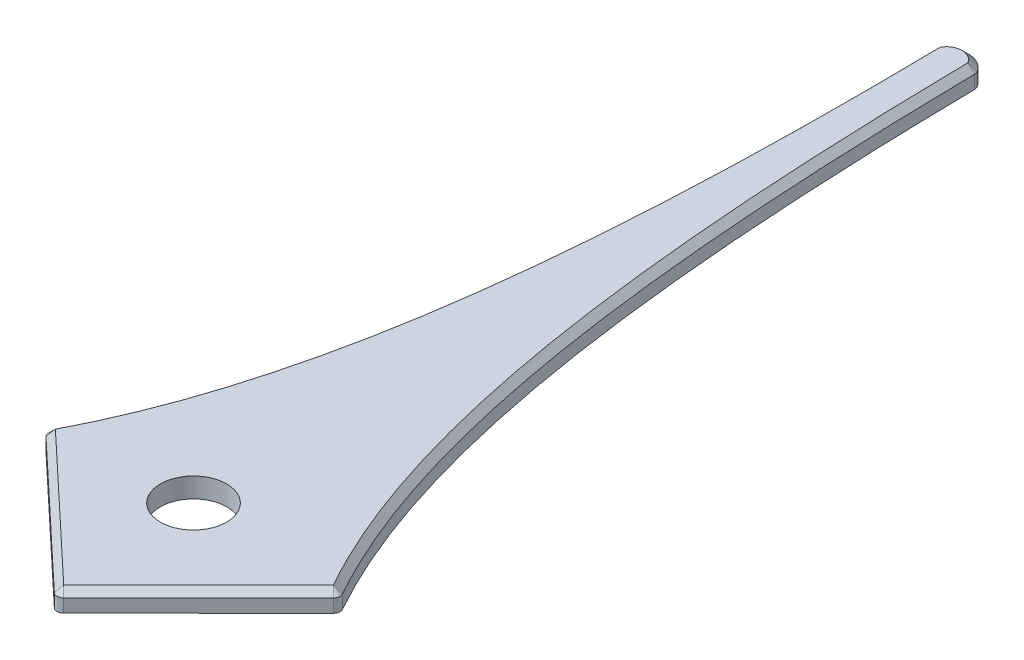
ISO-10303-21;
HEADER;
FILE_DESCRIPTION(('STEP AP214'),'2;1');
FILE_NAME('part.step','',(''),(''),'','','');
FILE_SCHEMA(('AUTOMOTIVE_DESIGN { 1 0 10303 214 1 1 1 1 }'));
ENDSEC;
DATA;
#1=APPLICATION_CONTEXT('core data for automotive mechanical design processes');
#2=APPLICATION_PROTOCOL_DEFINITION('international standard','automotive_design',2000,#1);
#3=PRODUCT_CONTEXT('',#1,'mechanical');
#4=PRODUCT('Part','Part','',(#3));
#5=PRODUCT_RELATED_PRODUCT_CATEGORY('part','',(#4));
#6=PRODUCT_DEFINITION_FORMATION('','',#4);
#7=PRODUCT_DEFINITION_CONTEXT('part definition',#1,'design');
#8=PRODUCT_DEFINITION('design','',#6,#7);
#9=PRODUCT_DEFINITION_SHAPE('','',#8);
#10=(LENGTH_UNIT() NAMED_UNIT(*) SI_UNIT(.MILLI.,.METRE.));
#11=(NAMED_UNIT(*) PLANE_ANGLE_UNIT() SI_UNIT($,.RADIAN.));
#12=(NAMED_UNIT(*) SI_UNIT($,.STERADIAN.) SOLID_ANGLE_UNIT());
#13=UNCERTAINTY_MEASURE_WITH_UNIT(LENGTH_MEASURE(1.E-05),#10,'distance_accuracy_value','');
#14=(GEOMETRIC_REPRESENTATION_CONTEXT(3) GLOBAL_UNCERTAINTY_ASSIGNED_CONTEXT((#13)) GLOBAL_UNIT_ASSIGNED_CONTEXT((#10,
#11,#12)) REPRESENTATION_CONTEXT('',''));
#15=CARTESIAN_POINT('',(0.,0.,0.));
#16=DIRECTION('',(0.,0.,1.));
#17=DIRECTION('',(1.,0.,0.));
#18=AXIS2_PLACEMENT_3D('',#15,#16,#17);
#19=CARTESIAN_POINT('',(-0.84427339324463,0.781119019034748,10.3159980699105));
#20=CARTESIAN_POINT('',(-0.482807728251816,0.781119019034748,9.63484541938807));
#21=CARTESIAN_POINT('',(-0.316238720875581,0.781119019034748,8.60682836334096));
#22=CARTESIAN_POINT('',(-0.344928680809462,0.781119019034748,6.89122524216324));
#23=B_SPLINE_CURVE_WITH_KNOTS('',3,(#19,#20,#21,#22),.UNSPECIFIED.,.F.,.F.,(4,4),(0.,1.),.UNSPECIFIED.);
#24=DIRECTION('',(0.,-1.,0.));
#25=VECTOR('',#24,1.);
#26=SURFACE_OF_LINEAR_EXTRUSION('',#23,#25);
#27=DIRECTION('',(0.,-1.,0.));
#28=VECTOR('',#27,1.);
#29=CARTESIAN_POINT('',(-0.833990106525606,0.693399019034748,10.2964251031646));
#30=LINE('',#29,#28);
#31=CARTESIAN_POINT('',(-0.833990106525606,0.693399019034748,10.2964251031646));
#32=VERTEX_POINT('',#31);
#33=CARTESIAN_POINT('',(-0.833990106525606,0.751879019034748,10.2964251031646));
#34=VERTEX_POINT('',#33);
#35=EDGE_CURVE('E181',#32,#34,#30,.F.);
#36=ORIENTED_EDGE('',*,*,#35,.T.);
#37=CARTESIAN_POINT('',(-0.833990106525606,0.751879019034749,10.2964251031646));
#38=CARTESIAN_POINT('',(-0.480137373854941,0.751879019034749,9.6161219200585));
#39=CARTESIAN_POINT('',(-0.316961311436214,0.751879019034749,8.59329344205403));
#40=CARTESIAN_POINT('',(-0.344812516242735,0.751879019034749,6.89823283345259));
#41=B_SPLINE_CURVE_WITH_KNOTS('',3,(#37,#38,#39,#40),.UNSPECIFIED.,.F.,.F.,(4,4),
(0.00953194338408838,0.998637715516818),.UNSPECIFIED.);
#42=CARTESIAN_POINT('',(-0.344812516242735,0.751879019034748,6.89823283345259));
#43=VERTEX_POINT('',#42);
#44=EDGE_CURVE('E485',#34,#43,#41,.T.);
#45=ORIENTED_EDGE('',*,*,#44,.T.);
#46=DIRECTION('',(0.,-1.,0.));
#47=VECTOR('',#46,1.);
#48=CARTESIAN_POINT('',(-0.344812516242735,0.781119019034748,6.89823283345259));
#49=LINE('',#48,#47);
#50=CARTESIAN_POINT('',(-0.344812516242735,0.693399019034748,6.89823283345259));
#51=VERTEX_POINT('',#50);
#52=EDGE_CURVE('E487',#43,#51,#49,.T.);
#53=ORIENTED_EDGE('',*,*,#52,.T.);
#54=CARTESIAN_POINT('',(-0.84427339324463,0.693399019034748,10.3159980699105));
#55=CARTESIAN_POINT('',(-0.482807728251816,0.693399019034748,9.63484541938807));
#56=CARTESIAN_POINT('',(-0.316238720875581,0.693399019034748,8.60682836334096));
#57=CARTESIAN_POINT('',(-0.344928680809462,0.693399019034748,6.89122524216324));
#58=B_SPLINE_CURVE_WITH_KNOTS('',3,(#54,#55,#56,#57),.UNSPECIFIED.,.F.,.F.,(4,4),(0.,1.),.UNSPECIFIED.);
#59=EDGE_CURVE('E136',#32,#51,#58,.T.);
#60=ORIENTED_EDGE('',*,*,#59,.F.);
#61=EDGE_LOOP('',(#36,#45,#53,#60));
#62=FACE_BOUND('',#61,.T.);
#63=ADVANCED_FACE('F34',(#62),#26,.T.);
#64=CARTESIAN_POINT('',(-2.99700158061435,0.781119019034748,8.29250056360764));
#65=DIRECTION('',(-0.684897970978588,0.,0.728638984236647));
#66=DIRECTION('',(0.728638984236647,0.,0.684897970978588));
#67=AXIS2_PLACEMENT_3D('',#64,#65,#66);
#68=PLANE('',#67);
#69=DIRECTION('',(0.,-1.,0.));
#70=VECTOR('',#69,1.);
#71=CARTESIAN_POINT('',(-0.214885813562541,0.781119019034748,10.9076028091697));
#72=LINE('',#71,#70);
#73=CARTESIAN_POINT('',(-0.214885813562542,0.693399019034748,10.9076028091697));
#74=VERTEX_POINT('',#73);
#75=CARTESIAN_POINT('',(-0.214885813562541,0.751879019034748,10.9076028091697));
#76=VERTEX_POINT('',#75);
#77=EDGE_CURVE('E489',#74,#76,#72,.F.);
#78=ORIENTED_EDGE('',*,*,#77,.T.);
#79=DIRECTION('',(-0.728638984236647,0.,-0.684897970978588));
#80=VECTOR('',#79,1.);
#81=CARTESIAN_POINT('',(-2.99700158061435,0.751879019034747,8.29250056360764));
#82=LINE('',#81,#80);
#83=CARTESIAN_POINT('',(-0.828075788039018,0.751879019034747,10.3312233147575));
#84=VERTEX_POINT('',#83);
#85=EDGE_CURVE('E428',#76,#84,#82,.T.);
#86=ORIENTED_EDGE('',*,*,#85,.T.);
#87=DIRECTION('',(0.,-1.,0.));
#88=VECTOR('',#87,1.);
#89=CARTESIAN_POINT('',(-0.828075788039018,0.781119019034748,10.3312233147575));
#90=LINE('',#89,#88);
#91=CARTESIAN_POINT('',(-0.828075788039018,0.693399019034748,10.3312233147575));
#92=VERTEX_POINT('',#91);
#93=EDGE_CURVE('E502',#84,#92,#90,.T.);
#94=ORIENTED_EDGE('',*,*,#93,.T.);
#95=DIRECTION('',(-0.728638984236647,0.,-0.684897970978588));
#96=VECTOR('',#95,1.);
#97=CARTESIAN_POINT('',(-2.99700158061435,0.693399019034748,8.29250056360764));
#98=LINE('',#97,#96);
#99=EDGE_CURVE('E220',#74,#92,#98,.T.);
#100=ORIENTED_EDGE('',*,*,#99,.F.);
#101=EDGE_LOOP('',(#78,#86,#94,#100));
#102=FACE_BOUND('',#101,.T.);
#103=ADVANCED_FACE('F506',(#102),#68,.T.);
#104=CARTESIAN_POINT('',(-0.850072535414796,0.781119019034748,11.5820228825341));
#105=DIRECTION('',(-0.706667353058945,0.,-0.707545936403188));
#106=DIRECTION('',(-0.707545936403188,0.,0.706667353058945));
#107=AXIS2_PLACEMENT_3D('',#104,#105,#106);
#108=PLANE('',#107);
#109=DIRECTION('',(0.,-1.,0.));
#110=VECTOR('',#109,1.);
#111=CARTESIAN_POINT('',(0.421242565500472,0.781119019034748,10.3122864159032));
#112=LINE('',#111,#110);
#113=CARTESIAN_POINT('',(0.421242565500472,0.693399019034748,10.3122864159032));
#114=VERTEX_POINT('',#113);
#115=CARTESIAN_POINT('',(0.421242565500472,0.751879019034748,10.3122864159032));
#116=VERTEX_POINT('',#115);
#117=EDGE_CURVE('E493',#114,#116,#112,.F.);
#118=ORIENTED_EDGE('',*,*,#117,.T.);
#119=DIRECTION('',(-0.707545936403188,0.,0.706667353058945));
#120=VECTOR('',#119,1.);
#121=CARTESIAN_POINT('',(-0.174196443487683,0.751879019034749,10.9069860484511));
#122=LINE('',#121,#120);
#123=CARTESIAN_POINT('',(-0.174196443487683,0.751879019034748,10.9069860484511));
#124=VERTEX_POINT('',#123);
#125=EDGE_CURVE('E435',#116,#124,#122,.T.);
#126=ORIENTED_EDGE('',*,*,#125,.T.);
#127=DIRECTION('',(0.,-1.,0.));
#128=VECTOR('',#127,1.);
#129=CARTESIAN_POINT('',(-0.174196443487683,0.693399019034748,10.9069860484511));
#130=LINE('',#129,#128);
#131=CARTESIAN_POINT('',(-0.174196443487683,0.693399019034748,10.9069860484511));
#132=VERTEX_POINT('',#131);
#133=EDGE_CURVE('E491',#124,#132,#130,.T.);
#134=ORIENTED_EDGE('',*,*,#133,.T.);
#135=DIRECTION('',(0.707545936403188,0.,-0.706667353058945));
#136=VECTOR('',#135,1.);
#137=CARTESIAN_POINT('',(-0.850072535414796,0.693399019034748,11.5820228825341));
#138=LINE('',#137,#136);
#139=EDGE_CURVE('E227',#132,#114,#138,.T.);
#140=ORIENTED_EDGE('',*,*,#139,.T.);
#141=EDGE_LOOP('',(#118,#126,#134,#140));
#142=FACE_BOUND('',#141,.T.);
#143=ADVANCED_FACE('F202',(#142),#108,.F.);
#144=CARTESIAN_POINT('',(0.436971273393723,0.781119019034748,10.2965772388702));
#145=CARTESIAN_POINT('',(0.0550268824383199,0.781119019034748,9.62669303805619));
#146=CARTESIAN_POINT('',(-0.142623365273902,0.781119019034748,8.60419673912823));
#147=CARTESIAN_POINT('',(-0.165944125072515,0.781119019034748,6.88851223276986));
#148=B_SPLINE_CURVE_WITH_KNOTS('',3,(#144,#145,#146,#147),.UNSPECIFIED.,.F.,.F.,(4,4),(0.,1.),.UNSPECIFIED.);
#149=DIRECTION('',(0.,-1.,0.));
#150=VECTOR('',#149,1.);
#151=SURFACE_OF_LINEAR_EXTRUSION('',#148,#150);
#152=DIRECTION('',(0.,-1.,0.));
#153=VECTOR('',#152,1.);
#154=CARTESIAN_POINT('',(-0.165847845947759,0.693399019034748,6.89552012547847));
#155=LINE('',#154,#153);
#156=CARTESIAN_POINT('',(-0.165847845947759,0.693399019034748,6.89552012547847));
#157=VERTEX_POINT('',#156);
#158=CARTESIAN_POINT('',(-0.165847845947759,0.751879019034748,6.89552012547847));
#159=VERTEX_POINT('',#158);
#160=EDGE_CURVE('E173',#157,#159,#155,.F.);
#161=ORIENTED_EDGE('',*,*,#160,.T.);
#162=CARTESIAN_POINT('',(-0.165847845947759,0.751879019034748,6.89552012547847));
#163=CARTESIAN_POINT('',(-0.142311331277567,0.751879019034748,8.59064613522483));
#164=CARTESIAN_POINT('',(0.0517902716663454,0.751879019034748,9.60805907523397));
#165=CARTESIAN_POINT('',(0.426099481593648,0.751879019034748,10.2773249362536));
#166=B_SPLINE_CURVE_WITH_KNOTS('',3,(#162,#163,#164,#165),.UNSPECIFIED.,.F.,.F.,(4,4),
(0.00953194338408858,0.998637715516818),.UNSPECIFIED.);
#167=CARTESIAN_POINT('',(0.426099481593648,0.75187901903475,10.2773249362536));
#168=VERTEX_POINT('',#167);
#169=EDGE_CURVE('E11',#159,#168,#166,.T.);
#170=ORIENTED_EDGE('',*,*,#169,.T.);
#171=DIRECTION('',(0.,-1.,0.));
#172=VECTOR('',#171,1.);
#173=CARTESIAN_POINT('',(0.426099481593648,0.781119019034748,10.2773249362536));
#174=LINE('',#173,#172);
#175=CARTESIAN_POINT('',(0.426099481593648,0.693399019034748,10.2773249362536));
#176=VERTEX_POINT('',#175);
#177=EDGE_CURVE('E165',#168,#176,#174,.T.);
#178=ORIENTED_EDGE('',*,*,#177,.T.);
#179=CARTESIAN_POINT('',(0.436971273393723,0.693399019034748,10.2965772388702));
#180=CARTESIAN_POINT('',(0.0550268824383199,0.693399019034748,9.62669303805619));
#181=CARTESIAN_POINT('',(-0.142623365273902,0.693399019034748,8.60419673912823));
#182=CARTESIAN_POINT('',(-0.165944125072515,0.693399019034748,6.88851223276986));
#183=B_SPLINE_CURVE_WITH_KNOTS('',3,(#179,#180,#181,#182),.UNSPECIFIED.,.F.,.F.,(4,4),(0.,1.),.UNSPECIFIED.);
#184=EDGE_CURVE('E150',#176,#157,#183,.T.);
#185=ORIENTED_EDGE('',*,*,#184,.T.);
#186=EDGE_LOOP('',(#161,#170,#178,#185));
#187=FACE_BOUND('',#186,.T.);
#188=ADVANCED_FACE('F191',(#187),#151,.F.);
#189=CARTESIAN_POINT('',(-0.25481325555267,0.781119019034748,6.93097945338565));
#190=DIRECTION('',(0.,-1.,0.));
#191=DIRECTION('',(0.,0.,-1.));
#192=AXIS2_PLACEMENT_3D('',#189,#190,#191);
#193=CYLINDRICAL_SURFACE('',#192,0.09849460482244);
#194=DIRECTION('',(0.,-1.,0.));
#195=VECTOR('',#194,1.);
#196=CARTESIAN_POINT('',(-0.341231307663666,0.781119019034748,6.88372368708703));
#197=LINE('',#196,#195);
#198=CARTESIAN_POINT('',(-0.341231307663666,0.693399019034748,6.88372368708703));
#199=VERTEX_POINT('',#198);
#200=CARTESIAN_POINT('',(-0.341231307663666,0.751879019034748,6.88372368708703));
#201=VERTEX_POINT('',#200);
#202=EDGE_CURVE('E146',#199,#201,#197,.F.);
#203=ORIENTED_EDGE('',*,*,#202,.T.);
#204=CARTESIAN_POINT('',(-0.25481325555267,0.751879019034748,6.93097945338565));
#205=DIRECTION('',(0.,1.,0.));
#206=DIRECTION('',(0.,0.,1.));
#207=AXIS2_PLACEMENT_3D('',#204,#205,#206);
#208=CIRCLE('',#207,0.09849460482244);
#209=CARTESIAN_POINT('',(-0.169867161281203,0.751879019034748,6.88112618621938));
#210=VERTEX_POINT('',#209);
#211=EDGE_CURVE('E174',#201,#210,#208,.F.);
#212=ORIENTED_EDGE('',*,*,#211,.T.);
#213=DIRECTION('',(0.,-1.,0.));
#214=VECTOR('',#213,1.);
#215=CARTESIAN_POINT('',(-0.169867161281203,0.781119019034748,6.88112618621938));
#216=LINE('',#215,#214);
#217=CARTESIAN_POINT('',(-0.169867161281203,0.693399019034748,6.88112618621938));
#218=VERTEX_POINT('',#217);
#219=EDGE_CURVE('E148',#210,#218,#216,.T.);
#220=ORIENTED_EDGE('',*,*,#219,.T.);
#221=CARTESIAN_POINT('',(-0.25481325555267,0.693399019034748,6.93097945338565));
#222=DIRECTION('',(0.,1.,0.));
#223=DIRECTION('',(0.,0.,1.));
#224=AXIS2_PLACEMENT_3D('',#221,#222,#223);
#225=CIRCLE('',#224,0.09849460482244);
#226=EDGE_CURVE('E134',#199,#218,#225,.F.);
#227=ORIENTED_EDGE('',*,*,#226,.F.);
#228=EDGE_LOOP('',(#203,#212,#220,#227));
#229=FACE_BOUND('',#228,.T.);
#230=ADVANCED_FACE('F145',(#229),#193,.T.);
#231=CARTESIAN_POINT('',(-3.54899396528739,0.781119019034748,8.87974594542686));
#232=DIRECTION('',(0.,1.,0.));
#233=DIRECTION('',(0.,0.,1.));
#234=AXIS2_PLACEMENT_3D('',#231,#232,#233);
#235=PLANE('',#234);
#236=CARTESIAN_POINT('',(-0.808049371367605,0.781119019034748,10.3099179108584));
#237=CARTESIAN_POINT('',(-0.673071997666404,0.781119019034748,10.0497998542177));
#238=CARTESIAN_POINT('',(-0.582372473716355,0.781119019034748,9.77616981580804));
#239=CARTESIAN_POINT('',(-0.447791912541357,0.781119019034748,9.21532648869756));
#240=CARTESIAN_POINT('',(-0.404337697665234,0.781119019034748,8.92643623887617));
#241=CARTESIAN_POINT('',(-0.344494199605317,0.781119019034748,8.34953784067906));
#242=CARTESIAN_POINT('',(-0.328089215704498,0.781119019034748,8.05924765885427));
#243=CARTESIAN_POINT('',(-0.311154400935458,0.781119019034748,7.47855540265641));
#244=CARTESIAN_POINT('',(-0.310834637859471,0.781119019034748,7.18820162085901));
#245=CARTESIAN_POINT('',(-0.315576462423354,0.781119019034748,6.89775246164847));
#246=B_SPLINE_CURVE_WITH_KNOTS('',3,(#236,#237,#238,#239,#240,#241,#242,#243,#244,#245),
.UNSPECIFIED.,.F.,.F.,(4,2,2,2,4),(0.,0.0147760194086552,0.0295520388173104,0.0443280582259656,
0.0591040776346209),.UNSPECIFIED.);
#247=CARTESIAN_POINT('',(-0.315576462423352,0.781119019034748,6.89775246164847));
#248=VERTEX_POINT('',#247);
#249=CARTESIAN_POINT('',(-0.808049371367605,0.781119019034748,10.3099179108584));
#250=VERTEX_POINT('',#249);
#251=EDGE_CURVE('E446',#248,#250,#246,.F.);
#252=ORIENTED_EDGE('',*,*,#251,.T.);
#253=DIRECTION('',(0.728638984236647,0.,0.684897970978588));
#254=VECTOR('',#253,1.);
#255=CARTESIAN_POINT('',(-2.97697516394293,0.781119019034748,8.27119515970856));
#256=LINE('',#255,#254);
#257=CARTESIAN_POINT('',(-0.194859396891127,0.781119019034748,10.8862974052706));
#258=VERTEX_POINT('',#257);
#259=EDGE_CURVE('E426',#250,#258,#256,.T.);
#260=ORIENTED_EDGE('',*,*,#259,.T.);
#261=DIRECTION('',(0.707545936403188,0.,-0.706667353058945));
#262=VECTOR('',#261,1.);
#263=CARTESIAN_POINT('',(0.400579612097029,0.781119019034748,10.2915977727228));
#264=LINE('',#263,#262);
#265=CARTESIAN_POINT('',(0.400579612097027,0.781119019034748,10.2915977727228));
#266=VERTEX_POINT('',#265);
#267=EDGE_CURVE('E476',#258,#266,#264,.T.);
#268=ORIENTED_EDGE('',*,*,#267,.T.);
#269=CARTESIAN_POINT('',(-0.195085027792525,0.781119019034748,6.895926078402));
#270=CARTESIAN_POINT('',(-0.191023795240976,0.781119019034748,7.1862414369228));
#271=CARTESIAN_POINT('',(-0.181902087033121,0.781119019034748,7.47636203373418));
#272=CARTESIAN_POINT('',(-0.147440068846124,0.781119019034748,8.05563778441213));
#273=CARTESIAN_POINT('',(-0.12224479143337,0.781119019034748,8.34557794355415));
#274=CARTESIAN_POINT('',(-0.0450386576660064,0.781119019034748,8.91989274421253));
#275=CARTESIAN_POINT('',(0.00695766309965723,0.781119019034748,9.20691727088983));
#276=CARTESIAN_POINT('',(0.159007370220995,0.781119019034748,9.76579722101433));
#277=CARTESIAN_POINT('',(0.258140563916696,0.781119019034748,10.0363820216979));
#278=CARTESIAN_POINT('',(0.400579612097027,0.781119019034748,10.2915977727228));
#279=B_SPLINE_CURVE_WITH_KNOTS('',3,(#269,#270,#271,#272,#273,#274,#275,#276,#277,#278),
.UNSPECIFIED.,.F.,.F.,(4,2,2,2,4),(0.,0.0148859978871837,0.0297719957743674,0.0446579936615511,
0.0595439915487348),.UNSPECIFIED.);
#280=CARTESIAN_POINT('',(-0.195085027792525,0.781119019034748,6.895926078402));
#281=VERTEX_POINT('',#280);
#282=EDGE_CURVE('E409',#266,#281,#279,.F.);
#283=ORIENTED_EDGE('',*,*,#282,.T.);
#284=CARTESIAN_POINT('',(-0.25481325555267,0.781119019034748,6.93097945338565));
#285=DIRECTION('',(0.,1.,0.));
#286=DIRECTION('',(0.,0.,1.));
#287=AXIS2_PLACEMENT_3D('',#284,#285,#286);
#288=CIRCLE('',#287,0.0692546048224396);
#289=EDGE_CURVE('E252',#281,#248,#288,.T.);
#290=ORIENTED_EDGE('',*,*,#289,.T.);
#291=EDGE_LOOP('',(#252,#260,#268,#283,#290));
#292=FACE_BOUND('',#291,.T.);
#293=CARTESIAN_POINT('',(-0.221192362567505,0.781119019034748,10.2871364467844));
#294=DIRECTION('',(0.,1.,0.));
#295=DIRECTION('',(0.,0.,1.));
#296=AXIS2_PLACEMENT_3D('',#293,#294,#295);
#297=CIRCLE('',#296,0.1462);
#298=CARTESIAN_POINT('',(-0.221192362567505,0.781119019034748,10.4333364467844));
#299=VERTEX_POINT('',#298);
#300=EDGE_CURVE('E413',#299,#299,#297,.T.);
#301=ORIENTED_EDGE('',*,*,#300,.F.);
#302=EDGE_LOOP('',(#301));
#303=FACE_BOUND('',#302,.T.);
#304=ADVANCED_FACE('F452',(#292,#303),#235,.T.);
#305=CARTESIAN_POINT('',(-3.54899396528739,0.693399019034748,8.87974594542686));
#306=DIRECTION('',(0.,1.,0.));
#307=DIRECTION('',(0.,0.,1.));
#308=AXIS2_PLACEMENT_3D('',#305,#306,#307);
#309=PLANE('',#308);
#310=CARTESIAN_POINT('',(-0.221192362567505,0.693399019034748,10.2871364467844));
#311=DIRECTION('',(0.,1.,0.));
#312=DIRECTION('',(0.,0.,1.));
#313=AXIS2_PLACEMENT_3D('',#310,#311,#312);
#314=CIRCLE('',#313,0.1462);
#315=CARTESIAN_POINT('',(-0.221192362567505,0.693399019034748,10.4333364467844));
#316=VERTEX_POINT('',#315);
#317=EDGE_CURVE('E221',#316,#316,#314,.T.);
#318=ORIENTED_EDGE('',*,*,#317,.T.);
#319=EDGE_LOOP('',(#318));
#320=FACE_BOUND('',#319,.T.);
#321=ORIENTED_EDGE('',*,*,#226,.T.);
#322=CARTESIAN_POINT('',(-0.195085027792524,0.693399019034748,6.895926078402));
#323=DIRECTION('',(0.,1.,0.));
#324=DIRECTION('',(0.,0.,1.));
#325=AXIS2_PLACEMENT_3D('',#322,#323,#324);
#326=CIRCLE('',#325,0.02924);
#327=EDGE_CURVE('E140',#218,#157,#326,.F.);
#328=ORIENTED_EDGE('',*,*,#327,.T.);
#329=ORIENTED_EDGE('',*,*,#184,.F.);
#330=CARTESIAN_POINT('',(0.400579612097028,0.693399019034748,10.2915977727228));
#331=DIRECTION('',(0.,1.,0.));
#332=DIRECTION('',(0.,0.,1.));
#333=AXIS2_PLACEMENT_3D('',#330,#331,#332);
#334=CIRCLE('',#333,0.02924);
#335=EDGE_CURVE('E141',#176,#114,#334,.F.);
#336=ORIENTED_EDGE('',*,*,#335,.T.);
#337=ORIENTED_EDGE('',*,*,#139,.F.);
#338=CARTESIAN_POINT('',(-0.194859396891127,0.693399019034748,10.8862974052706));
#339=DIRECTION('',(0.,1.,0.));
#340=DIRECTION('',(0.,0.,1.));
#341=AXIS2_PLACEMENT_3D('',#338,#339,#340);
#342=CIRCLE('',#341,0.02924);
#343=EDGE_CURVE('E161',#132,#74,#342,.F.);
#344=ORIENTED_EDGE('',*,*,#343,.T.);
#345=ORIENTED_EDGE('',*,*,#99,.T.);
#346=CARTESIAN_POINT('',(-0.808049371367604,0.693399019034748,10.3099179108584));
#347=DIRECTION('',(0.,1.,0.));
#348=DIRECTION('',(0.,0.,1.));
#349=AXIS2_PLACEMENT_3D('',#346,#347,#348);
#350=CIRCLE('',#349,0.02924);
#351=EDGE_CURVE('E156',#92,#32,#350,.F.);
#352=ORIENTED_EDGE('',*,*,#351,.T.);
#353=ORIENTED_EDGE('',*,*,#59,.T.);
#354=CARTESIAN_POINT('',(-0.315576462423353,0.693399019034748,6.89775246164847));
#355=DIRECTION('',(0.,1.,0.));
#356=DIRECTION('',(0.,0.,1.));
#357=AXIS2_PLACEMENT_3D('',#354,#355,#356);
#358=CIRCLE('',#357,0.02924);
#359=EDGE_CURVE('E131',#51,#199,#358,.F.);
#360=ORIENTED_EDGE('',*,*,#359,.T.);
#361=EDGE_LOOP('',(#321,#328,#329,#336,#337,#344,#345,#352,#353,#360));
#362=FACE_BOUND('',#361,.T.);
#363=ADVANCED_FACE('F133',(#320,#362),#309,.F.);
#364=CARTESIAN_POINT('',(-0.195085027792524,0.737259019034748,6.895926078402));
#365=DIRECTION('',(0.,-1.,0.));
#366=DIRECTION('',(0.,0.,-1.));
#367=AXIS2_PLACEMENT_3D('',#364,#365,#366);
#368=CYLINDRICAL_SURFACE('',#367,0.02924);
#369=ORIENTED_EDGE('',*,*,#219,.F.);
#370=CARTESIAN_POINT('',(-0.195085027792524,0.751879019034748,6.895926078402));
#371=DIRECTION('',(0.,1.,0.));
#372=DIRECTION('',(0.,0.,1.));
#373=AXIS2_PLACEMENT_3D('',#370,#371,#372);
#374=CIRCLE('',#373,0.02924);
#375=EDGE_CURVE('E46',#210,#159,#374,.F.);
#376=ORIENTED_EDGE('',*,*,#375,.T.);
#377=ORIENTED_EDGE('',*,*,#160,.F.);
#378=ORIENTED_EDGE('',*,*,#327,.F.);
#379=EDGE_LOOP('',(#369,#376,#377,#378));
#380=FACE_BOUND('',#379,.T.);
#381=ADVANCED_FACE('F237',(#380),#368,.T.);
#382=CARTESIAN_POINT('',(-0.315576462423353,0.737259019034748,6.89775246164847));
#383=DIRECTION('',(0.,-1.,0.));
#384=DIRECTION('',(0.,0.,-1.));
#385=AXIS2_PLACEMENT_3D('',#382,#383,#384);
#386=CYLINDRICAL_SURFACE('',#385,0.02924);
#387=ORIENTED_EDGE('',*,*,#52,.F.);
#388=CARTESIAN_POINT('',(-0.315576462423353,0.751879019034748,6.89775246164847));
#389=DIRECTION('',(0.,1.,0.));
#390=DIRECTION('',(0.,0.,1.));
#391=AXIS2_PLACEMENT_3D('',#388,#389,#390);
#392=CIRCLE('',#391,0.02924);
#393=EDGE_CURVE('E154',#43,#201,#392,.F.);
#394=ORIENTED_EDGE('',*,*,#393,.T.);
#395=ORIENTED_EDGE('',*,*,#202,.F.);
#396=ORIENTED_EDGE('',*,*,#359,.F.);
#397=EDGE_LOOP('',(#387,#394,#395,#396));
#398=FACE_BOUND('',#397,.T.);
#399=ADVANCED_FACE('F152',(#398),#386,.T.);
#400=CARTESIAN_POINT('',(0.400579612097028,0.737259019034748,10.2915977727228));
#401=DIRECTION('',(0.,-1.,0.));
#402=DIRECTION('',(0.,0.,-1.));
#403=AXIS2_PLACEMENT_3D('',#400,#401,#402);
#404=CYLINDRICAL_SURFACE('',#403,0.02924);
#405=ORIENTED_EDGE('',*,*,#177,.F.);
#406=CARTESIAN_POINT('',(0.400579612097028,0.751879019034748,10.2915977727228));
#407=DIRECTION('',(0.,1.,0.));
#408=DIRECTION('',(0.,0.,1.));
#409=AXIS2_PLACEMENT_3D('',#406,#407,#408);
#410=CIRCLE('',#409,0.02924);
#411=EDGE_CURVE('E176',#168,#116,#410,.F.);
#412=ORIENTED_EDGE('',*,*,#411,.T.);
#413=ORIENTED_EDGE('',*,*,#117,.F.);
#414=ORIENTED_EDGE('',*,*,#335,.F.);
#415=EDGE_LOOP('',(#405,#412,#413,#414));
#416=FACE_BOUND('',#415,.T.);
#417=ADVANCED_FACE('F515',(#416),#404,.T.);
#418=CARTESIAN_POINT('',(-0.194859396891127,0.781119019034748,10.8862974052706));
#419=DIRECTION('',(0.,1.,0.));
#420=DIRECTION('',(0.,0.,1.));
#421=AXIS2_PLACEMENT_3D('',#418,#419,#420);
#422=CYLINDRICAL_SURFACE('',#421,0.02924);
#423=ORIENTED_EDGE('',*,*,#133,.F.);
#424=CARTESIAN_POINT('',(-0.194859396891127,0.751879019034748,10.8862974052706));
#425=DIRECTION('',(0.,1.,0.));
#426=DIRECTION('',(0.,0.,1.));
#427=AXIS2_PLACEMENT_3D('',#424,#425,#426);
#428=CIRCLE('',#427,0.02924);
#429=EDGE_CURVE('E420',#124,#76,#428,.F.);
#430=ORIENTED_EDGE('',*,*,#429,.T.);
#431=ORIENTED_EDGE('',*,*,#77,.F.);
#432=ORIENTED_EDGE('',*,*,#343,.F.);
#433=EDGE_LOOP('',(#423,#430,#431,#432));
#434=FACE_BOUND('',#433,.T.);
#435=ADVANCED_FACE('F510',(#434),#422,.T.);
#436=CARTESIAN_POINT('',(-0.808049371367604,0.737259019034748,10.3099179108584));
#437=DIRECTION('',(0.,-1.,0.));
#438=DIRECTION('',(0.,0.,-1.));
#439=AXIS2_PLACEMENT_3D('',#436,#437,#438);
#440=CYLINDRICAL_SURFACE('',#439,0.02924);
#441=ORIENTED_EDGE('',*,*,#93,.F.);
#442=CARTESIAN_POINT('',(-0.808049371367604,0.751879019034748,10.3099179108584));
#443=DIRECTION('',(0.,1.,0.));
#444=DIRECTION('',(0.,0.,1.));
#445=AXIS2_PLACEMENT_3D('',#442,#443,#444);
#446=CIRCLE('',#445,0.02924);
#447=EDGE_CURVE('E432',#84,#34,#446,.F.);
#448=ORIENTED_EDGE('',*,*,#447,.T.);
#449=ORIENTED_EDGE('',*,*,#35,.F.);
#450=ORIENTED_EDGE('',*,*,#351,.F.);
#451=EDGE_LOOP('',(#441,#448,#449,#450));
#452=FACE_BOUND('',#451,.T.);
#453=ADVANCED_FACE('F295',(#452),#440,.T.);
#454=CARTESIAN_POINT('',(-0.221192362567505,0.693399019034748,10.2871364467844));
#455=DIRECTION('',(0.,1.,0.));
#456=DIRECTION('',(0.,0.,1.));
#457=AXIS2_PLACEMENT_3D('',#454,#455,#456);
#458=CYLINDRICAL_SURFACE('',#457,0.1462);
#459=ORIENTED_EDGE('',*,*,#317,.F.);
#460=EDGE_LOOP('',(#459));
#461=FACE_BOUND('',#460,.T.);
#462=ORIENTED_EDGE('',*,*,#300,.T.);
#463=EDGE_LOOP('',(#462));
#464=FACE_BOUND('',#463,.T.);
#465=ADVANCED_FACE('F462',(#461,#464),#458,.F.);
#466=CARTESIAN_POINT('',(0.400579612097028,0.751879019034748,10.2915977727228));
#467=DIRECTION('',(0.,-1.,0.));
#468=DIRECTION('',(0.,0.,-1.));
#469=AXIS2_PLACEMENT_3D('',#466,#467,#468);
#470=CONICAL_SURFACE('',#469,0.0292400000000005,0.78539816339745);
#471=CARTESIAN_POINT('',(0.400579612097027,0.781119019034748,10.2915977727228));
#472=CARTESIAN_POINT('',(0.426099481593648,0.751879019034748,10.2773249362536));
#473=B_SPLINE_CURVE_WITH_KNOTS('',1,(#471,#472),.UNSPECIFIED.,.F.,.F.,(2,2),(0.,1.),.UNSPECIFIED.);
#474=EDGE_CURVE('E401',#266,#168,#473,.T.);
#475=ORIENTED_EDGE('',*,*,#474,.F.);
#476=DIRECTION('',(-0.499689277391123,0.707106781186555,-0.500310529631673));
#477=VECTOR('',#476,1.);
#478=CARTESIAN_POINT('',(0.421242565500472,0.751879019034748,10.3122864159032));
#479=LINE('',#478,#477);
#480=EDGE_CURVE('E410',#116,#266,#479,.T.);
#481=ORIENTED_EDGE('',*,*,#480,.F.);
#482=ORIENTED_EDGE('',*,*,#411,.F.);
#483=EDGE_LOOP('',(#475,#481,#482));
#484=FACE_BOUND('',#483,.T.);
#485=ADVANCED_FACE('F36',(#484),#470,.T.);
#486=CARTESIAN_POINT('',(-0.870735488818239,0.781119019034748,11.5613342393537));
#487=DIRECTION('',(0.499689277391128,0.707106781186548,0.500310529631679));
#488=DIRECTION('',(0.,-0.577589240790984,0.816327550020514));
#489=AXIS2_PLACEMENT_3D('',#486,#487,#488);
#490=PLANE('',#489);
#491=ORIENTED_EDGE('',*,*,#480,.T.);
#492=ORIENTED_EDGE('',*,*,#267,.F.);
#493=DIRECTION('',(-0.499689277391127,0.707106781186548,-0.500310529631681));
#494=VECTOR('',#493,1.);
#495=CARTESIAN_POINT('',(-0.174196443487683,0.751879019034749,10.9069860484511));
#496=LINE('',#495,#494);
#497=EDGE_CURVE('E411',#124,#258,#496,.T.);
#498=ORIENTED_EDGE('',*,*,#497,.F.);
#499=ORIENTED_EDGE('',*,*,#125,.F.);
#500=EDGE_LOOP('',(#491,#492,#498,#499));
#501=FACE_BOUND('',#500,.T.);
#502=ADVANCED_FACE('F374',(#501),#490,.T.);
#503=CARTESIAN_POINT('',(0.400579612097027,0.781119019034748,10.2915977727228));
#504=CARTESIAN_POINT('',(0.258140563916696,0.781119019034748,10.0363820216979));
#505=CARTESIAN_POINT('',(0.159007370220995,0.781119019034748,9.76579722101433));
#506=CARTESIAN_POINT('',(0.00695766309965723,0.781119019034748,9.20691727088983));
#507=CARTESIAN_POINT('',(-0.0450386576660064,0.781119019034748,8.91989274421253));
#508=CARTESIAN_POINT('',(-0.12224479143337,0.781119019034748,8.34557794355415));
#509=CARTESIAN_POINT('',(-0.147440068846124,0.781119019034748,8.05563778441213));
#510=CARTESIAN_POINT('',(-0.181902087033121,0.781119019034748,7.47636203373418));
#511=CARTESIAN_POINT('',(-0.191023795240976,0.781119019034748,7.1862414369228));
#512=CARTESIAN_POINT('',(-0.195085027792525,0.781119019034748,6.895926078402));
#513=CARTESIAN_POINT('',(0.426099481593648,0.751879019034748,10.2773249362536));
#514=CARTESIAN_POINT('',(0.285188012527798,0.751879019034748,10.0248646827191));
#515=CARTESIAN_POINT('',(0.186769575005268,0.751879019034748,9.75646667480994));
#516=CARTESIAN_POINT('',(0.0356272081590663,0.751879019034748,9.20090610892401));
#517=CARTESIAN_POINT('',(-0.0161850568477021,0.751879019034748,8.91507184997638));
#518=CARTESIAN_POINT('',(-0.0931392011023028,0.751879019034748,8.34261150440134));
#519=CARTESIAN_POINT('',(-0.118284794427199,0.751879019034748,8.05335015738403));
#520=CARTESIAN_POINT('',(-0.152680434832369,0.751879019034748,7.47517909331));
#521=CARTESIAN_POINT('',(-0.161791826577346,0.751879019034748,7.18548081914601));
#522=CARTESIAN_POINT('',(-0.165847845947759,0.751879019034748,6.89552012547847));
#523=B_SPLINE_SURFACE_WITH_KNOTS('',1,3,((#503,#504,#505,#506,#507,#508,#509,#510,#511,#512),
(#513,#514,#515,#516,#517,#518,#519,#520,#521,#522)),.UNSPECIFIED.,.F.,.F.,.F.,(2,2),(4,2,2,2,
4),(0.,1.),(0.,0.0148859978871837,0.0297719957743674,0.0446579936615511,0.0595439915487348),.UNSPECIFIED.);
#524=CARTESIAN_POINT('',(-0.165847845947759,0.751879019034748,6.89552012547847));
#525=CARTESIAN_POINT('',(-0.195085027792525,0.781119019034748,6.895926078402));
#526=B_SPLINE_CURVE_WITH_KNOTS('',1,(#524,#525),.UNSPECIFIED.,.F.,.F.,(2,2),(0.,1.),.UNSPECIFIED.);
#527=EDGE_CURVE('E246',#281,#159,#526,.F.);
#528=ORIENTED_EDGE('',*,*,#474,.T.);
#529=ORIENTED_EDGE('',*,*,#169,.F.);
#530=ORIENTED_EDGE('',*,*,#527,.F.);
#531=ORIENTED_EDGE('',*,*,#282,.F.);
#532=EDGE_LOOP('',(#528,#529,#530,#531));
#533=FACE_BOUND('',#532,.T.);
#534=ADVANCED_FACE('F364',(#533),#523,.T.);
#535=CARTESIAN_POINT('',(-0.194859396891127,0.751879019034748,10.8862974052706));
#536=DIRECTION('',(0.,-1.,0.));
#537=DIRECTION('',(0.,0.,-1.));
#538=AXIS2_PLACEMENT_3D('',#535,#536,#537);
#539=CONICAL_SURFACE('',#538,0.0292400000000005,0.78539816339745);
#540=ORIENTED_EDGE('',*,*,#429,.F.);
#541=ORIENTED_EDGE('',*,*,#497,.T.);
#542=DIRECTION('',(0.484295999699869,0.707106781186548,-0.515225566790609));
#543=VECTOR('',#542,1.);
#544=CARTESIAN_POINT('',(-0.214885813562541,0.751879019034748,10.9076028091697));
#545=LINE('',#544,#543);
#546=EDGE_CURVE('E189',#76,#258,#545,.T.);
#547=ORIENTED_EDGE('',*,*,#546,.F.);
#548=EDGE_LOOP('',(#540,#541,#547));
#549=FACE_BOUND('',#548,.T.);
#550=ADVANCED_FACE('F347',(#549),#539,.T.);
#551=CARTESIAN_POINT('',(-0.195085027792524,0.751879019034748,6.895926078402));
#552=DIRECTION('',(0.,-1.,0.));
#553=DIRECTION('',(0.,0.,-1.));
#554=AXIS2_PLACEMENT_3D('',#551,#552,#553);
#555=CONICAL_SURFACE('',#554,0.0292400000000005,0.78539816339745);
#556=ORIENTED_EDGE('',*,*,#527,.T.);
#557=ORIENTED_EDGE('',*,*,#375,.F.);
#558=DIRECTION('',(0.609840096347917,-0.707106781186539,-0.357903697782484));
#559=VECTOR('',#558,1.);
#560=CARTESIAN_POINT('',(-0.195085027792525,0.781119019034748,6.895926078402));
#561=LINE('',#560,#559);
#562=EDGE_CURVE('E243',#281,#210,#561,.T.);
#563=ORIENTED_EDGE('',*,*,#562,.F.);
#564=EDGE_LOOP('',(#556,#557,#563));
#565=FACE_BOUND('',#564,.T.);
#566=ADVANCED_FACE('F242',(#565),#555,.T.);
#567=CARTESIAN_POINT('',(-2.99700158061435,0.751879019034748,8.29250056360764));
#568=DIRECTION('',(0.484295999699868,-0.707106781186546,-0.515225566790612));
#569=DIRECTION('',(0.,0.588893684828165,-0.80821050968761));
#570=AXIS2_PLACEMENT_3D('',#567,#568,#569);
#571=PLANE('',#570);
#572=ORIENTED_EDGE('',*,*,#546,.T.);
#573=ORIENTED_EDGE('',*,*,#259,.F.);
#574=DIRECTION('',(0.484295999699863,0.707106781186545,-0.515225566790618));
#575=VECTOR('',#574,1.);
#576=CARTESIAN_POINT('',(-0.828075788039018,0.751879019034747,10.3312233147575));
#577=LINE('',#576,#575);
#578=EDGE_CURVE('E253',#84,#250,#577,.T.);
#579=ORIENTED_EDGE('',*,*,#578,.F.);
#580=ORIENTED_EDGE('',*,*,#85,.F.);
#581=EDGE_LOOP('',(#572,#573,#579,#580));
#582=FACE_BOUND('',#581,.T.);
#583=ADVANCED_FACE('F340',(#582),#571,.F.);
#584=CARTESIAN_POINT('',(-0.25481325555267,0.751879019034748,6.93097945338565));
#585=DIRECTION('',(0.,-1.,0.));
#586=DIRECTION('',(0.,0.,-1.));
#587=AXIS2_PLACEMENT_3D('',#584,#585,#586);
#588=CONICAL_SURFACE('',#587,0.09849460482244,0.78539816339745);
#589=ORIENTED_EDGE('',*,*,#562,.T.);
#590=ORIENTED_EDGE('',*,*,#211,.F.);
#591=DIRECTION('',(-0.620407491098395,-0.707106781186547,-0.339255869498223));
#592=VECTOR('',#591,1.);
#593=CARTESIAN_POINT('',(-0.315576462423352,0.781119019034748,6.89775246164847));
#594=LINE('',#593,#592);
#595=EDGE_CURVE('E257',#248,#201,#594,.T.);
#596=ORIENTED_EDGE('',*,*,#595,.F.);
#597=ORIENTED_EDGE('',*,*,#289,.F.);
#598=EDGE_LOOP('',(#589,#590,#596,#597));
#599=FACE_BOUND('',#598,.T.);
#600=ADVANCED_FACE('F249',(#599),#588,.T.);
#601=CARTESIAN_POINT('',(-0.808049371367604,0.751879019034748,10.3099179108584));
#602=DIRECTION('',(0.,-1.,0.));
#603=DIRECTION('',(0.,0.,-1.));
#604=AXIS2_PLACEMENT_3D('',#601,#602,#603);
#605=CONICAL_SURFACE('',#604,0.0292400000000005,0.78539816339745);
#606=ORIENTED_EDGE('',*,*,#447,.F.);
#607=ORIENTED_EDGE('',*,*,#578,.T.);
#608=CARTESIAN_POINT('',(-0.833990106525606,0.751879019034749,10.2964251031646));
#609=CARTESIAN_POINT('',(-0.808049371367605,0.781119019034748,10.3099179108584));
#610=B_SPLINE_CURVE_WITH_KNOTS('',1,(#608,#609),.UNSPECIFIED.,.F.,.F.,(2,2),(0.,1.),.UNSPECIFIED.);
#611=EDGE_CURVE('E268',#34,#250,#610,.T.);
#612=ORIENTED_EDGE('',*,*,#611,.F.);
#613=EDGE_LOOP('',(#606,#607,#612));
#614=FACE_BOUND('',#613,.T.);
#615=ADVANCED_FACE('F329',(#614),#605,.T.);
#616=CARTESIAN_POINT('',(-0.315576462423353,0.751879019034748,6.89775246164847));
#617=DIRECTION('',(0.,-1.,0.));
#618=DIRECTION('',(0.,0.,-1.));
#619=AXIS2_PLACEMENT_3D('',#616,#617,#618);
#620=CONICAL_SURFACE('',#619,0.0292400000000005,0.78539816339745);
#621=ORIENTED_EDGE('',*,*,#595,.T.);
#622=ORIENTED_EDGE('',*,*,#393,.F.);
#623=CARTESIAN_POINT('',(-0.315576462423354,0.781119019034748,6.89775246164847));
#624=CARTESIAN_POINT('',(-0.344812516242735,0.751879019034749,6.89823283345259));
#625=B_SPLINE_CURVE_WITH_KNOTS('',1,(#623,#624),.UNSPECIFIED.,.F.,.F.,(2,2),(0.,1.),.UNSPECIFIED.);
#626=EDGE_CURVE('E276',#248,#43,#625,.T.);
#627=ORIENTED_EDGE('',*,*,#626,.F.);
#628=EDGE_LOOP('',(#621,#622,#627));
#629=FACE_BOUND('',#628,.T.);
#630=ADVANCED_FACE('F294',(#629),#620,.T.);
#631=CARTESIAN_POINT('',(-0.833990106525606,0.751879019034749,10.2964251031646));
#632=CARTESIAN_POINT('',(-0.700459467267298,0.751879019034749,10.0391149254106));
#633=CARTESIAN_POINT('',(-0.610405258958124,0.751879019034749,9.76768908908708));
#634=CARTESIAN_POINT('',(-0.47662900374901,0.751879019034749,9.21017902578719));
#635=CARTESIAN_POINT('',(-0.433323764738285,0.751879019034749,8.9224882820553));
#636=CARTESIAN_POINT('',(-0.373676153580736,0.751879019034749,8.34745324188023));
#637=CARTESIAN_POINT('',(-0.357300347898722,0.751879019034749,8.0578428541109));
#638=CARTESIAN_POINT('',(-0.340398503049624,0.751879019034749,7.4782584489119));
#639=CARTESIAN_POINT('',(-0.340076231905928,0.751879019034749,7.18832715239));
#640=CARTESIAN_POINT('',(-0.344812516242735,0.751879019034749,6.89823283345259));
#641=CARTESIAN_POINT('',(-0.808049371367605,0.781119019034748,10.3099179108584));
#642=CARTESIAN_POINT('',(-0.673071997666404,0.781119019034748,10.0497998542177));
#643=CARTESIAN_POINT('',(-0.582372473716355,0.781119019034748,9.77616981580804));
#644=CARTESIAN_POINT('',(-0.447791912541357,0.781119019034748,9.21532648869756));
#645=CARTESIAN_POINT('',(-0.404337697665234,0.781119019034748,8.92643623887617));
#646=CARTESIAN_POINT('',(-0.344494199605317,0.781119019034748,8.34953784067906));
#647=CARTESIAN_POINT('',(-0.328089215704498,0.781119019034748,8.05924765885427));
#648=CARTESIAN_POINT('',(-0.311154400935458,0.781119019034748,7.47855540265641));
#649=CARTESIAN_POINT('',(-0.310834637859471,0.781119019034748,7.18820162085901));
#650=CARTESIAN_POINT('',(-0.315576462423354,0.781119019034748,6.89775246164847));
#651=B_SPLINE_SURFACE_WITH_KNOTS('',1,3,((#631,#632,#633,#634,#635,#636,#637,#638,#639,#640),
(#641,#642,#643,#644,#645,#646,#647,#648,#649,#650)),.UNSPECIFIED.,.F.,.F.,.F.,(2,2),(4,2,2,2,
4),(0.,1.),(0.,0.0147760194086552,0.0295520388173104,0.0443280582259656,0.0591040776346209),.UNSPECIFIED.);
#652=ORIENTED_EDGE('',*,*,#611,.T.);
#653=ORIENTED_EDGE('',*,*,#251,.F.);
#654=ORIENTED_EDGE('',*,*,#626,.T.);
#655=ORIENTED_EDGE('',*,*,#44,.F.);
#656=EDGE_LOOP('',(#652,#653,#654,#655));
#657=FACE_BOUND('',#656,.T.);
#658=ADVANCED_FACE('F282',(#657),#651,.T.);
#659=CLOSED_SHELL('',(#63,#103,#143,#188,#230,#304,#363,#381,#399,#417,#435,#453,#465,#485,#502,
#534,#550,#566,#583,#600,#615,#630,#658));
#660=MANIFOLD_SOLID_BREP('B2',#659);
#661=ADVANCED_BREP_SHAPE_REPRESENTATION('',(#18,#660),#14);
#662=SHAPE_DEFINITION_REPRESENTATION(#9,#661);
ENDSEC;
END-ISO-10303-21;
